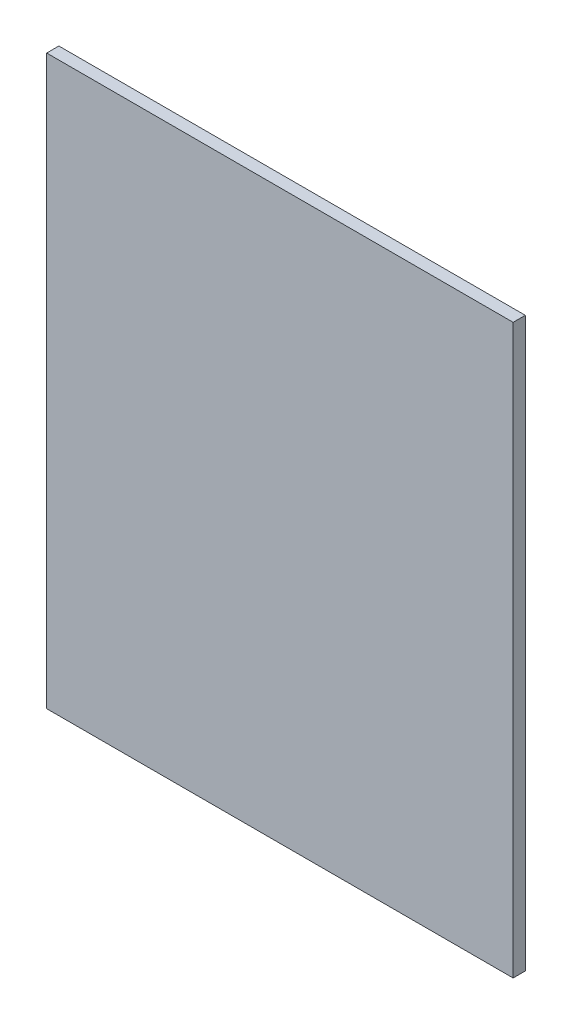
ISO-10303-21;
HEADER;
FILE_DESCRIPTION(('STEP AP214'),'2;1');
FILE_NAME('part.step','',(''),(''),'','','');
FILE_SCHEMA(('AUTOMOTIVE_DESIGN { 1 0 10303 214 1 1 1 1 }'));
ENDSEC;
DATA;
#1=APPLICATION_CONTEXT('core data for automotive mechanical design processes');
#2=APPLICATION_PROTOCOL_DEFINITION('international standard','automotive_design',2000,#1);
#3=PRODUCT_CONTEXT('',#1,'mechanical');
#4=PRODUCT('Part','Part','',(#3));
#5=PRODUCT_RELATED_PRODUCT_CATEGORY('part','',(#4));
#6=PRODUCT_DEFINITION_FORMATION('','',#4);
#7=PRODUCT_DEFINITION_CONTEXT('part definition',#1,'design');
#8=PRODUCT_DEFINITION('design','',#6,#7);
#9=PRODUCT_DEFINITION_SHAPE('','',#8);
#10=(LENGTH_UNIT() NAMED_UNIT(*) SI_UNIT(.MILLI.,.METRE.));
#11=(NAMED_UNIT(*) PLANE_ANGLE_UNIT() SI_UNIT($,.RADIAN.));
#12=(NAMED_UNIT(*) SI_UNIT($,.STERADIAN.) SOLID_ANGLE_UNIT());
#13=UNCERTAINTY_MEASURE_WITH_UNIT(LENGTH_MEASURE(1.E-05),#10,'distance_accuracy_value','');
#14=(GEOMETRIC_REPRESENTATION_CONTEXT(3) GLOBAL_UNCERTAINTY_ASSIGNED_CONTEXT((#13)) GLOBAL_UNIT_ASSIGNED_CONTEXT((#10,
#11,#12)) REPRESENTATION_CONTEXT('',''));
#15=CARTESIAN_POINT('',(0.,0.,0.));
#16=DIRECTION('',(0.,0.,1.));
#17=DIRECTION('',(1.,0.,0.));
#18=AXIS2_PLACEMENT_3D('',#15,#16,#17);
#19=CARTESIAN_POINT('',(151.884088258819,-292.926224711825,3.));
#20=DIRECTION('',(-1.,0.,0.));
#21=DIRECTION('',(0.,0.,1.));
#22=AXIS2_PLACEMENT_3D('',#19,#20,#21);
#23=PLANE('',#22);
#24=DIRECTION('',(0.,1.,0.));
#25=VECTOR('',#24,1.);
#26=CARTESIAN_POINT('',(151.884088258819,-292.926224711825,0.));
#27=LINE('',#26,#25);
#28=CARTESIAN_POINT('',(151.884088258819,-432.926224711825,0.));
#29=VERTEX_POINT('',#28);
#30=CARTESIAN_POINT('',(151.884088258819,-292.926224711825,0.));
#31=VERTEX_POINT('',#30);
#32=EDGE_CURVE('E96',#29,#31,#27,.T.);
#33=ORIENTED_EDGE('',*,*,#32,.T.);
#34=DIRECTION('',(0.,0.,-1.));
#35=VECTOR('',#34,1.);
#36=CARTESIAN_POINT('',(151.884088258819,-292.926224711825,3.));
#37=LINE('',#36,#35);
#38=CARTESIAN_POINT('',(151.884088258819,-292.926224711825,3.));
#39=VERTEX_POINT('',#38);
#40=EDGE_CURVE('E11',#39,#31,#37,.T.);
#41=ORIENTED_EDGE('',*,*,#40,.F.);
#42=DIRECTION('',(0.,1.,0.));
#43=VECTOR('',#42,1.);
#44=CARTESIAN_POINT('',(151.884088258819,-292.926224711825,3.));
#45=LINE('',#44,#43);
#46=CARTESIAN_POINT('',(151.884088258819,-432.926224711825,3.));
#47=VERTEX_POINT('',#46);
#48=EDGE_CURVE('E84',#47,#39,#45,.T.);
#49=ORIENTED_EDGE('',*,*,#48,.F.);
#50=DIRECTION('',(0.,0.,-1.));
#51=VECTOR('',#50,1.);
#52=CARTESIAN_POINT('',(151.884088258819,-432.926224711825,3.));
#53=LINE('',#52,#51);
#54=EDGE_CURVE('E92',#47,#29,#53,.T.);
#55=ORIENTED_EDGE('',*,*,#54,.T.);
#56=EDGE_LOOP('',(#33,#41,#49,#55));
#57=FACE_BOUND('',#56,.T.);
#58=ADVANCED_FACE('F33',(#57),#23,.F.);
#59=CARTESIAN_POINT('',(151.884088258819,-292.926224711825,3.));
#60=DIRECTION('',(0.,-1.,0.));
#61=DIRECTION('',(0.,0.,-1.));
#62=AXIS2_PLACEMENT_3D('',#59,#60,#61);
#63=PLANE('',#62);
#64=DIRECTION('',(-1.,0.,0.));
#65=VECTOR('',#64,1.);
#66=CARTESIAN_POINT('',(151.884088258819,-292.926224711825,0.));
#67=LINE('',#66,#65);
#68=CARTESIAN_POINT('',(36.8840882588194,-292.926224711825,0.));
#69=VERTEX_POINT('',#68);
#70=EDGE_CURVE('E88',#31,#69,#67,.T.);
#71=ORIENTED_EDGE('',*,*,#70,.T.);
#72=DIRECTION('',(0.,0.,-1.));
#73=VECTOR('',#72,1.);
#74=CARTESIAN_POINT('',(36.8840882588194,-292.926224711825,3.));
#75=LINE('',#74,#73);
#76=CARTESIAN_POINT('',(36.8840882588194,-292.926224711825,3.));
#77=VERTEX_POINT('',#76);
#78=EDGE_CURVE('E41',#77,#69,#75,.T.);
#79=ORIENTED_EDGE('',*,*,#78,.F.);
#80=DIRECTION('',(-1.,0.,0.));
#81=VECTOR('',#80,1.);
#82=CARTESIAN_POINT('',(151.884088258819,-292.926224711825,3.));
#83=LINE('',#82,#81);
#84=EDGE_CURVE('E79',#39,#77,#83,.T.);
#85=ORIENTED_EDGE('',*,*,#84,.F.);
#86=ORIENTED_EDGE('',*,*,#40,.T.);
#87=EDGE_LOOP('',(#71,#79,#85,#86));
#88=FACE_BOUND('',#87,.T.);
#89=ADVANCED_FACE('F87',(#88),#63,.F.);
#90=CARTESIAN_POINT('',(36.8840882588194,-292.926224711825,3.));
#91=DIRECTION('',(1.,0.,0.));
#92=DIRECTION('',(0.,0.,-1.));
#93=AXIS2_PLACEMENT_3D('',#90,#91,#92);
#94=PLANE('',#93);
#95=DIRECTION('',(0.,-1.,0.));
#96=VECTOR('',#95,1.);
#97=CARTESIAN_POINT('',(36.8840882588194,-292.926224711825,0.));
#98=LINE('',#97,#96);
#99=CARTESIAN_POINT('',(36.8840882588194,-432.926224711825,0.));
#100=VERTEX_POINT('',#99);
#101=EDGE_CURVE('E66',#69,#100,#98,.T.);
#102=ORIENTED_EDGE('',*,*,#101,.T.);
#103=DIRECTION('',(0.,0.,-1.));
#104=VECTOR('',#103,1.);
#105=CARTESIAN_POINT('',(36.8840882588194,-432.926224711825,3.));
#106=LINE('',#105,#104);
#107=CARTESIAN_POINT('',(36.8840882588194,-432.926224711825,3.));
#108=VERTEX_POINT('',#107);
#109=EDGE_CURVE('E89',#108,#100,#106,.T.);
#110=ORIENTED_EDGE('',*,*,#109,.F.);
#111=DIRECTION('',(0.,-1.,0.));
#112=VECTOR('',#111,1.);
#113=CARTESIAN_POINT('',(36.8840882588194,-292.926224711825,3.));
#114=LINE('',#113,#112);
#115=EDGE_CURVE('E82',#77,#108,#114,.T.);
#116=ORIENTED_EDGE('',*,*,#115,.F.);
#117=ORIENTED_EDGE('',*,*,#78,.T.);
#118=EDGE_LOOP('',(#102,#110,#116,#117));
#119=FACE_BOUND('',#118,.T.);
#120=ADVANCED_FACE('F90',(#119),#94,.F.);
#121=CARTESIAN_POINT('',(151.884088258819,-432.926224711825,3.));
#122=DIRECTION('',(0.,1.,0.));
#123=DIRECTION('',(0.,0.,1.));
#124=AXIS2_PLACEMENT_3D('',#121,#122,#123);
#125=PLANE('',#124);
#126=DIRECTION('',(1.,0.,0.));
#127=VECTOR('',#126,1.);
#128=CARTESIAN_POINT('',(151.884088258819,-432.926224711825,0.));
#129=LINE('',#128,#127);
#130=EDGE_CURVE('E72',#100,#29,#129,.T.);
#131=ORIENTED_EDGE('',*,*,#130,.T.);
#132=ORIENTED_EDGE('',*,*,#54,.F.);
#133=DIRECTION('',(1.,0.,0.));
#134=VECTOR('',#133,1.);
#135=CARTESIAN_POINT('',(151.884088258819,-432.926224711825,3.));
#136=LINE('',#135,#134);
#137=EDGE_CURVE('E49',#108,#47,#136,.T.);
#138=ORIENTED_EDGE('',*,*,#137,.F.);
#139=ORIENTED_EDGE('',*,*,#109,.T.);
#140=EDGE_LOOP('',(#131,#132,#138,#139));
#141=FACE_BOUND('',#140,.T.);
#142=ADVANCED_FACE('F103',(#141),#125,.F.);
#143=CARTESIAN_POINT('',(0.,0.,3.));
#144=DIRECTION('',(0.,0.,-1.));
#145=DIRECTION('',(-1.,0.,0.));
#146=AXIS2_PLACEMENT_3D('',#143,#144,#145);
#147=PLANE('',#146);
#148=ORIENTED_EDGE('',*,*,#48,.T.);
#149=ORIENTED_EDGE('',*,*,#84,.T.);
#150=ORIENTED_EDGE('',*,*,#115,.T.);
#151=ORIENTED_EDGE('',*,*,#137,.T.);
#152=EDGE_LOOP('',(#148,#149,#150,#151));
#153=FACE_BOUND('',#152,.T.);
#154=ADVANCED_FACE('F80',(#153),#147,.F.);
#155=CARTESIAN_POINT('',(0.,0.,0.));
#156=DIRECTION('',(0.,0.,-1.));
#157=DIRECTION('',(-1.,0.,0.));
#158=AXIS2_PLACEMENT_3D('',#155,#156,#157);
#159=PLANE('',#158);
#160=ORIENTED_EDGE('',*,*,#32,.F.);
#161=ORIENTED_EDGE('',*,*,#130,.F.);
#162=ORIENTED_EDGE('',*,*,#101,.F.);
#163=ORIENTED_EDGE('',*,*,#70,.F.);
#164=EDGE_LOOP('',(#160,#161,#162,#163));
#165=FACE_BOUND('',#164,.T.);
#166=ADVANCED_FACE('F106',(#165),#159,.T.);
#167=CLOSED_SHELL('',(#58,#89,#120,#142,#154,#166));
#168=MANIFOLD_SOLID_BREP('B2',#167);
#169=ADVANCED_BREP_SHAPE_REPRESENTATION('',(#18,#168),#14);
#170=SHAPE_DEFINITION_REPRESENTATION(#9,#169);
ENDSEC;
END-ISO-10303-21;
